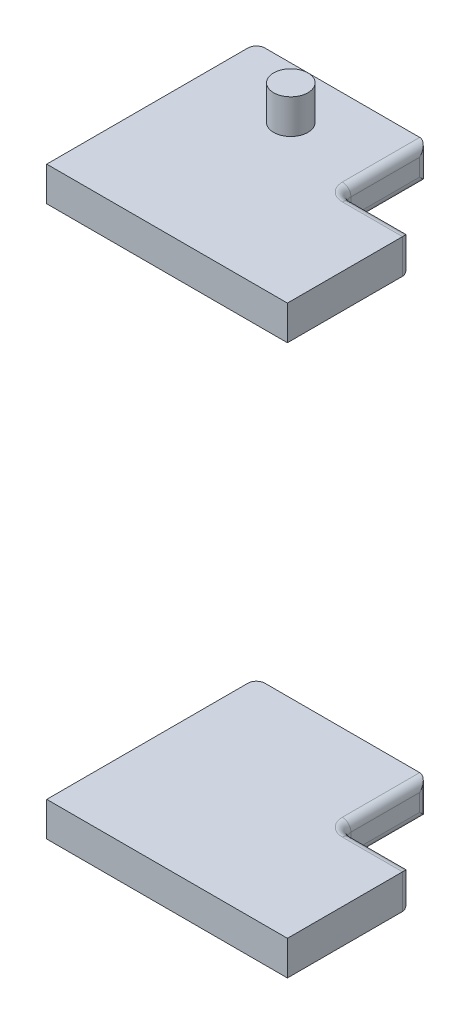
ISO-10303-21;
HEADER;
FILE_DESCRIPTION(('STEP AP214'),'2;1');
FILE_NAME('part.step','',(''),(''),'','','');
FILE_SCHEMA(('AUTOMOTIVE_DESIGN { 1 0 10303 214 1 1 1 1 }'));
ENDSEC;
DATA;
#1=APPLICATION_CONTEXT('core data for automotive mechanical design processes');
#2=APPLICATION_PROTOCOL_DEFINITION('international standard','automotive_design',2000,#1);
#3=PRODUCT_CONTEXT('',#1,'mechanical');
#4=PRODUCT('Part','Part','',(#3));
#5=PRODUCT_RELATED_PRODUCT_CATEGORY('part','',(#4));
#6=PRODUCT_DEFINITION_FORMATION('','',#4);
#7=PRODUCT_DEFINITION_CONTEXT('part definition',#1,'design');
#8=PRODUCT_DEFINITION('design','',#6,#7);
#9=PRODUCT_DEFINITION_SHAPE('','',#8);
#10=(LENGTH_UNIT() NAMED_UNIT(*) SI_UNIT(.MILLI.,.METRE.));
#11=(NAMED_UNIT(*) PLANE_ANGLE_UNIT() SI_UNIT($,.RADIAN.));
#12=(NAMED_UNIT(*) SI_UNIT($,.STERADIAN.) SOLID_ANGLE_UNIT());
#13=UNCERTAINTY_MEASURE_WITH_UNIT(LENGTH_MEASURE(1.E-05),#10,'distance_accuracy_value','');
#14=(GEOMETRIC_REPRESENTATION_CONTEXT(3) GLOBAL_UNCERTAINTY_ASSIGNED_CONTEXT((#13)) GLOBAL_UNIT_ASSIGNED_CONTEXT((#10,
#11,#12)) REPRESENTATION_CONTEXT('',''));
#15=CARTESIAN_POINT('',(0.,0.,0.));
#16=DIRECTION('',(0.,0.,1.));
#17=DIRECTION('',(1.,0.,0.));
#18=AXIS2_PLACEMENT_3D('',#15,#16,#17);
#19=CARTESIAN_POINT('',(70.,-165.,-54.9999999999997));
#20=DIRECTION('',(1.,0.,0.));
#21=DIRECTION('',(0.,0.,-1.));
#22=AXIS2_PLACEMENT_3D('',#19,#20,#21);
#23=CYLINDRICAL_SURFACE('',#22,5.);
#24=CARTESIAN_POINT('',(105.,-165.,-54.9999999999997));
#25=DIRECTION('',(-1.,0.,0.));
#26=DIRECTION('',(0.,0.,-1.));
#27=AXIS2_PLACEMENT_3D('',#24,#25,#26);
#28=CIRCLE('',#27,5.);
#29=CARTESIAN_POINT('',(105.,-165.,-59.9999999999997));
#30=VERTEX_POINT('',#29);
#31=CARTESIAN_POINT('',(105.,-170.,-54.9999999999997));
#32=VERTEX_POINT('',#31);
#33=EDGE_CURVE('E66',#30,#32,#28,.T.);
#34=ORIENTED_EDGE('',*,*,#33,.F.);
#35=DIRECTION('',(-1.,0.,0.));
#36=VECTOR('',#35,1.);
#37=CARTESIAN_POINT('',(70.,-165.,-59.9999999999997));
#38=LINE('',#37,#36);
#39=CARTESIAN_POINT('',(135.,-165.,-59.9999999999997));
#40=VERTEX_POINT('',#39);
#41=EDGE_CURVE('E202',#40,#30,#38,.T.);
#42=ORIENTED_EDGE('',*,*,#41,.F.);
#43=CARTESIAN_POINT('',(135.,-165.,-54.9999999999997));
#44=DIRECTION('',(-0.707106781186547,-0.707106781186547,0.));
#45=DIRECTION('',(0.707106781186547,-0.707106781186547,0.));
#46=AXIS2_PLACEMENT_3D('',#43,#44,#45);
#47=ELLIPSE('',#46,7.07106781186547,5.);
#48=CARTESIAN_POINT('',(140.,-170.,-54.9999999999997));
#49=VERTEX_POINT('',#48);
#50=EDGE_CURVE('E199',#49,#40,#47,.F.);
#51=ORIENTED_EDGE('',*,*,#50,.F.);
#52=DIRECTION('',(-1.,0.,0.));
#53=VECTOR('',#52,1.);
#54=CARTESIAN_POINT('',(70.,-170.,-54.9999999999997));
#55=LINE('',#54,#53);
#56=EDGE_CURVE('E74',#49,#32,#55,.T.);
#57=ORIENTED_EDGE('',*,*,#56,.T.);
#58=EDGE_LOOP('',(#34,#42,#51,#57));
#59=FACE_BOUND('',#58,.T.);
#60=ADVANCED_FACE('F57',(#59),#23,.T.);
#61=CARTESIAN_POINT('',(0.,170.,-59.9999999999997));
#62=DIRECTION('',(0.,0.,1.));
#63=DIRECTION('',(1.,0.,0.));
#64=AXIS2_PLACEMENT_3D('',#61,#62,#63);
#65=PLANE('',#64);
#66=DIRECTION('',(1.,0.,0.));
#67=VECTOR('',#66,1.);
#68=CARTESIAN_POINT('',(120.,-155.,-59.9999999999997));
#69=LINE('',#68,#67);
#70=CARTESIAN_POINT('',(105.,-155.,-59.9999999999997));
#71=VERTEX_POINT('',#70);
#72=CARTESIAN_POINT('',(135.,-155.,-59.9999999999997));
#73=VERTEX_POINT('',#72);
#74=EDGE_CURVE('E198',#71,#73,#69,.T.);
#75=ORIENTED_EDGE('',*,*,#74,.T.);
#76=DIRECTION('',(0.,-1.,0.));
#77=VECTOR('',#76,1.);
#78=CARTESIAN_POINT('',(135.,-160.,-59.9999999999997));
#79=LINE('',#78,#77);
#80=EDGE_CURVE('E228',#73,#40,#79,.T.);
#81=ORIENTED_EDGE('',*,*,#80,.T.);
#82=ORIENTED_EDGE('',*,*,#41,.T.);
#83=DIRECTION('',(0.,1.,0.));
#84=VECTOR('',#83,1.);
#85=CARTESIAN_POINT('',(105.,-160.,-59.9999999999997));
#86=LINE('',#85,#84);
#87=EDGE_CURVE('E197',#30,#71,#86,.T.);
#88=ORIENTED_EDGE('',*,*,#87,.T.);
#89=EDGE_LOOP('',(#75,#81,#82,#88));
#90=FACE_BOUND('',#89,.T.);
#91=ADVANCED_FACE('F353',(#90),#65,.F.);
#92=CARTESIAN_POINT('',(135.,-160.,-54.9999999999997));
#93=DIRECTION('',(0.,-1.,0.));
#94=DIRECTION('',(0.,0.,-1.));
#95=AXIS2_PLACEMENT_3D('',#92,#93,#94);
#96=CYLINDRICAL_SURFACE('',#95,5.);
#97=CARTESIAN_POINT('',(135.,-155.,-54.9999999999997));
#98=DIRECTION('',(0.707106781186547,-0.707106781186547,0.));
#99=DIRECTION('',(-0.707106781186547,-0.707106781186547,0.));
#100=AXIS2_PLACEMENT_3D('',#97,#98,#99);
#101=ELLIPSE('',#100,7.07106781186547,5.);
#102=CARTESIAN_POINT('',(140.,-150.,-54.9999999999997));
#103=VERTEX_POINT('',#102);
#104=EDGE_CURVE('E193',#73,#103,#101,.T.);
#105=ORIENTED_EDGE('',*,*,#104,.T.);
#106=DIRECTION('',(0.,-1.,0.));
#107=VECTOR('',#106,1.);
#108=CARTESIAN_POINT('',(140.,-160.,-54.9999999999997));
#109=LINE('',#108,#107);
#110=EDGE_CURVE('E191',#103,#49,#109,.T.);
#111=ORIENTED_EDGE('',*,*,#110,.T.);
#112=ORIENTED_EDGE('',*,*,#50,.T.);
#113=ORIENTED_EDGE('',*,*,#80,.F.);
#114=EDGE_LOOP('',(#105,#111,#112,#113));
#115=FACE_BOUND('',#114,.T.);
#116=ADVANCED_FACE('F324',(#115),#96,.T.);
#117=CARTESIAN_POINT('',(0.,-170.,-59.9999999999998));
#118=DIRECTION('',(0.,1.,0.));
#119=DIRECTION('',(0.,0.,1.));
#120=AXIS2_PLACEMENT_3D('',#117,#118,#119);
#121=PLANE('',#120);
#122=CARTESIAN_POINT('',(50.,-170.,-79.9999999999997));
#123=DIRECTION('',(0.,1.,0.));
#124=DIRECTION('',(0.,0.,1.));
#125=AXIS2_PLACEMENT_3D('',#122,#123,#124);
#126=CIRCLE('',#125,10.);
#127=CARTESIAN_POINT('',(50.,-170.,-69.9999999999996));
#128=VERTEX_POINT('',#127);
#129=EDGE_CURVE('E13',#128,#128,#126,.F.);
#130=ORIENTED_EDGE('',*,*,#129,.F.);
#131=EDGE_LOOP('',(#130));
#132=FACE_BOUND('',#131,.T.);
#133=DIRECTION('',(0.,0.,-1.));
#134=VECTOR('',#133,1.);
#135=CARTESIAN_POINT('',(140.,-170.,-21.5224999999996));
#136=LINE('',#135,#134);
#137=CARTESIAN_POINT('',(140.,-170.,11.9550000000004));
#138=VERTEX_POINT('',#137);
#139=EDGE_CURVE('E232',#138,#49,#136,.T.);
#140=ORIENTED_EDGE('',*,*,#139,.F.);
#141=DIRECTION('',(-1.,0.,0.));
#142=VECTOR('',#141,1.);
#143=CARTESIAN_POINT('',(70.,-170.,11.9550000000004));
#144=LINE('',#143,#142);
#145=CARTESIAN_POINT('',(0.,-170.,11.9550000000004));
#146=VERTEX_POINT('',#145);
#147=EDGE_CURVE('E256',#138,#146,#144,.T.);
#148=ORIENTED_EDGE('',*,*,#147,.T.);
#149=DIRECTION('',(0.,0.,-1.));
#150=VECTOR('',#149,1.);
#151=CARTESIAN_POINT('',(0.,-170.,-46.5224999999996));
#152=LINE('',#151,#150);
#153=CARTESIAN_POINT('',(0.,-170.,-105.));
#154=VERTEX_POINT('',#153);
#155=EDGE_CURVE('E271',#146,#154,#152,.T.);
#156=ORIENTED_EDGE('',*,*,#155,.T.);
#157=CARTESIAN_POINT('',(5.,-170.,-105.));
#158=DIRECTION('',(0.,1.,0.));
#159=DIRECTION('',(0.,0.,1.));
#160=AXIS2_PLACEMENT_3D('',#157,#158,#159);
#161=CIRCLE('',#160,5.);
#162=CARTESIAN_POINT('',(5.,-170.,-110.));
#163=VERTEX_POINT('',#162);
#164=EDGE_CURVE('E212',#163,#154,#161,.T.);
#165=ORIENTED_EDGE('',*,*,#164,.F.);
#166=DIRECTION('',(-1.,0.,0.));
#167=VECTOR('',#166,1.);
#168=CARTESIAN_POINT('',(50.,-170.,-110.));
#169=LINE('',#168,#167);
#170=CARTESIAN_POINT('',(95.,-170.,-110.));
#171=VERTEX_POINT('',#170);
#172=EDGE_CURVE('E209',#171,#163,#169,.T.);
#173=ORIENTED_EDGE('',*,*,#172,.F.);
#174=DIRECTION('',(0.,0.,-1.));
#175=VECTOR('',#174,1.);
#176=CARTESIAN_POINT('',(95.,-170.,-87.4999999999997));
#177=LINE('',#176,#175);
#178=CARTESIAN_POINT('',(95.,-170.,-65.0000002732813));
#179=VERTEX_POINT('',#178);
#180=EDGE_CURVE('E204',#179,#171,#177,.T.);
#181=ORIENTED_EDGE('',*,*,#180,.F.);
#182=CARTESIAN_POINT('',(105.,-170.,-64.9999999999997));
#183=DIRECTION('',(0.,-1.,0.));
#184=DIRECTION('',(0.,0.,1.));
#185=AXIS2_PLACEMENT_3D('',#182,#183,#184);
#186=CIRCLE('',#185,10.);
#187=EDGE_CURVE('E208',#32,#179,#186,.T.);
#188=ORIENTED_EDGE('',*,*,#187,.F.);
#189=ORIENTED_EDGE('',*,*,#56,.F.);
#190=EDGE_LOOP('',(#140,#148,#156,#165,#173,#181,#188,#189));
#191=FACE_BOUND('',#190,.T.);
#192=ADVANCED_FACE('F320',(#132,#191),#121,.F.);
#193=CARTESIAN_POINT('',(105.,-165.,-64.9999999999997));
#194=DIRECTION('',(0.,1.,0.));
#195=DIRECTION('',(-0.980849428772772,0.,-0.194767548827127));
#196=AXIS2_PLACEMENT_3D('',#193,#194,#195);
#197=TOROIDAL_SURFACE('',#196,10.,5.);
#198=CARTESIAN_POINT('',(105.,-165.,-64.9999999999997));
#199=DIRECTION('',(0.,-1.,0.));
#200=DIRECTION('',(0.,0.,1.));
#201=AXIS2_PLACEMENT_3D('',#198,#199,#200);
#202=CIRCLE('',#201,5.);
#203=CARTESIAN_POINT('',(100.,-165.,-64.9999999999997));
#204=VERTEX_POINT('',#203);
#205=EDGE_CURVE('E290',#30,#204,#202,.T.);
#206=ORIENTED_EDGE('',*,*,#205,.F.);
#207=ORIENTED_EDGE('',*,*,#33,.T.);
#208=ORIENTED_EDGE('',*,*,#187,.T.);
#209=CARTESIAN_POINT('',(95.,-165.,-65.0000002732813));
#210=DIRECTION('',(2.73281642870771E-08,0.,-1.));
#211=DIRECTION('',(-1.,0.,-2.73281642870771E-08));
#212=AXIS2_PLACEMENT_3D('',#209,#210,#211);
#213=CIRCLE('',#212,5.);
#214=EDGE_CURVE('E286',#204,#179,#213,.T.);
#215=ORIENTED_EDGE('',*,*,#214,.F.);
#216=EDGE_LOOP('',(#206,#207,#208,#215));
#217=FACE_BOUND('',#216,.T.);
#218=ADVANCED_FACE('F323',(#217),#197,.T.);
#219=CARTESIAN_POINT('',(105.,-160.,-64.9999999999997));
#220=DIRECTION('',(0.,-1.,0.));
#221=DIRECTION('',(0.,0.,-1.));
#222=AXIS2_PLACEMENT_3D('',#219,#220,#221);
#223=CYLINDRICAL_SURFACE('',#222,5.);
#224=ORIENTED_EDGE('',*,*,#87,.F.);
#225=ORIENTED_EDGE('',*,*,#205,.T.);
#226=DIRECTION('',(0.,1.,0.));
#227=VECTOR('',#226,1.);
#228=CARTESIAN_POINT('',(100.,-160.,-64.9999999999997));
#229=LINE('',#228,#227);
#230=CARTESIAN_POINT('',(100.,-155.,-64.9999999821408));
#231=VERTEX_POINT('',#230);
#232=EDGE_CURVE('E217',#204,#231,#229,.T.);
#233=ORIENTED_EDGE('',*,*,#232,.T.);
#234=CARTESIAN_POINT('',(105.,-155.,-64.9999999999997));
#235=DIRECTION('',(0.,1.,0.));
#236=DIRECTION('',(0.,0.,-1.));
#237=AXIS2_PLACEMENT_3D('',#234,#235,#236);
#238=CIRCLE('',#237,5.);
#239=EDGE_CURVE('E272',#231,#71,#238,.T.);
#240=ORIENTED_EDGE('',*,*,#239,.T.);
#241=EDGE_LOOP('',(#224,#225,#233,#240));
#242=FACE_BOUND('',#241,.T.);
#243=ADVANCED_FACE('F367',(#242),#223,.F.);
#244=CARTESIAN_POINT('',(70.,-155.,-54.9999999999997));
#245=DIRECTION('',(1.,0.,0.));
#246=DIRECTION('',(0.,0.,-1.));
#247=AXIS2_PLACEMENT_3D('',#244,#245,#246);
#248=CYLINDRICAL_SURFACE('',#247,5.);
#249=ORIENTED_EDGE('',*,*,#104,.F.);
#250=ORIENTED_EDGE('',*,*,#74,.F.);
#251=CARTESIAN_POINT('',(105.,-155.,-54.9999999999997));
#252=DIRECTION('',(1.,0.,0.));
#253=DIRECTION('',(0.,0.,-1.));
#254=AXIS2_PLACEMENT_3D('',#251,#252,#253);
#255=CIRCLE('',#254,5.);
#256=CARTESIAN_POINT('',(105.,-150.,-54.9999999999997));
#257=VERTEX_POINT('',#256);
#258=EDGE_CURVE('E216',#71,#257,#255,.T.);
#259=ORIENTED_EDGE('',*,*,#258,.T.);
#260=DIRECTION('',(1.,0.,0.));
#261=VECTOR('',#260,1.);
#262=CARTESIAN_POINT('',(70.,-150.,-54.9999999999997));
#263=LINE('',#262,#261);
#264=EDGE_CURVE('E222',#257,#103,#263,.T.);
#265=ORIENTED_EDGE('',*,*,#264,.T.);
#266=EDGE_LOOP('',(#249,#250,#259,#265));
#267=FACE_BOUND('',#266,.T.);
#268=ADVANCED_FACE('F371',(#267),#248,.T.);
#269=CARTESIAN_POINT('',(140.,0.,0.));
#270=DIRECTION('',(1.,0.,0.));
#271=DIRECTION('',(0.,0.,-1.));
#272=AXIS2_PLACEMENT_3D('',#269,#270,#271);
#273=PLANE('',#272);
#274=DIRECTION('',(0.,1.,0.));
#275=VECTOR('',#274,1.);
#276=CARTESIAN_POINT('',(140.,-160.,11.9550000000004));
#277=LINE('',#276,#275);
#278=CARTESIAN_POINT('',(140.,-150.,11.9550000000004));
#279=VERTEX_POINT('',#278);
#280=EDGE_CURVE('E227',#138,#279,#277,.T.);
#281=ORIENTED_EDGE('',*,*,#280,.F.);
#282=ORIENTED_EDGE('',*,*,#139,.T.);
#283=ORIENTED_EDGE('',*,*,#110,.F.);
#284=DIRECTION('',(0.,0.,1.));
#285=VECTOR('',#284,1.);
#286=CARTESIAN_POINT('',(140.,-150.,-21.5224999999996));
#287=LINE('',#286,#285);
#288=EDGE_CURVE('E155',#103,#279,#287,.T.);
#289=ORIENTED_EDGE('',*,*,#288,.T.);
#290=EDGE_LOOP('',(#281,#282,#283,#289));
#291=FACE_BOUND('',#290,.T.);
#292=ADVANCED_FACE('F332',(#291),#273,.T.);
#293=CARTESIAN_POINT('',(95.,-165.,-24.9999999999996));
#294=DIRECTION('',(0.,0.,-1.));
#295=DIRECTION('',(-1.,0.,0.));
#296=AXIS2_PLACEMENT_3D('',#293,#294,#295);
#297=CYLINDRICAL_SURFACE('',#296,5.);
#298=CARTESIAN_POINT('',(95.,-165.,-105.));
#299=DIRECTION('',(0.,-0.707106781186547,0.707106781186547));
#300=DIRECTION('',(0.,-0.707106781186547,-0.707106781186547));
#301=AXIS2_PLACEMENT_3D('',#298,#299,#300);
#302=ELLIPSE('',#301,7.07106781186547,5.);
#303=CARTESIAN_POINT('',(100.,-165.,-105.));
#304=VERTEX_POINT('',#303);
#305=EDGE_CURVE('E149',#304,#171,#302,.F.);
#306=ORIENTED_EDGE('',*,*,#305,.F.);
#307=DIRECTION('',(0.,0.,-1.));
#308=VECTOR('',#307,1.);
#309=CARTESIAN_POINT('',(100.,-165.,-24.9999999999996));
#310=LINE('',#309,#308);
#311=EDGE_CURVE('E192',#204,#304,#310,.T.);
#312=ORIENTED_EDGE('',*,*,#311,.F.);
#313=ORIENTED_EDGE('',*,*,#214,.T.);
#314=ORIENTED_EDGE('',*,*,#180,.T.);
#315=EDGE_LOOP('',(#306,#312,#313,#314));
#316=FACE_BOUND('',#315,.T.);
#317=ADVANCED_FACE('F350',(#316),#297,.T.);
#318=CARTESIAN_POINT('',(0.,0.,-110.));
#319=DIRECTION('',(0.,0.,-1.));
#320=DIRECTION('',(-1.,0.,0.));
#321=AXIS2_PLACEMENT_3D('',#318,#319,#320);
#322=PLANE('',#321);
#323=DIRECTION('',(0.,1.,0.));
#324=VECTOR('',#323,1.);
#325=CARTESIAN_POINT('',(5.,-160.,-110.));
#326=LINE('',#325,#324);
#327=CARTESIAN_POINT('',(5.,-150.,-110.));
#328=VERTEX_POINT('',#327);
#329=EDGE_CURVE('E172',#163,#328,#326,.T.);
#330=ORIENTED_EDGE('',*,*,#329,.T.);
#331=DIRECTION('',(1.,0.,0.));
#332=VECTOR('',#331,1.);
#333=CARTESIAN_POINT('',(50.,-150.,-110.));
#334=LINE('',#333,#332);
#335=CARTESIAN_POINT('',(95.,-150.,-110.));
#336=VERTEX_POINT('',#335);
#337=EDGE_CURVE('E163',#328,#336,#334,.T.);
#338=ORIENTED_EDGE('',*,*,#337,.T.);
#339=DIRECTION('',(0.,-1.,0.));
#340=VECTOR('',#339,1.);
#341=CARTESIAN_POINT('',(95.,-160.,-110.));
#342=LINE('',#341,#340);
#343=EDGE_CURVE('E142',#336,#171,#342,.T.);
#344=ORIENTED_EDGE('',*,*,#343,.T.);
#345=ORIENTED_EDGE('',*,*,#172,.T.);
#346=EDGE_LOOP('',(#330,#338,#344,#345));
#347=FACE_BOUND('',#346,.T.);
#348=ADVANCED_FACE('F170',(#347),#322,.T.);
#349=CARTESIAN_POINT('',(5.,0.,-105.));
#350=DIRECTION('',(0.,-1.,0.));
#351=DIRECTION('',(0.,0.,-1.));
#352=AXIS2_PLACEMENT_3D('',#349,#350,#351);
#353=CYLINDRICAL_SURFACE('',#352,5.);
#354=DIRECTION('',(0.,1.,0.));
#355=VECTOR('',#354,1.);
#356=CARTESIAN_POINT('',(0.,0.,-105.));
#357=LINE('',#356,#355);
#358=CARTESIAN_POINT('',(0.,-150.,-105.));
#359=VERTEX_POINT('',#358);
#360=EDGE_CURVE('E267',#154,#359,#357,.T.);
#361=ORIENTED_EDGE('',*,*,#360,.T.);
#362=CARTESIAN_POINT('',(5.,-150.,-105.));
#363=DIRECTION('',(0.,-1.,0.));
#364=DIRECTION('',(0.,0.,-1.));
#365=AXIS2_PLACEMENT_3D('',#362,#363,#364);
#366=CIRCLE('',#365,5.);
#367=EDGE_CURVE('E175',#359,#328,#366,.T.);
#368=ORIENTED_EDGE('',*,*,#367,.T.);
#369=ORIENTED_EDGE('',*,*,#329,.F.);
#370=ORIENTED_EDGE('',*,*,#164,.T.);
#371=EDGE_LOOP('',(#361,#368,#369,#370));
#372=FACE_BOUND('',#371,.T.);
#373=ADVANCED_FACE('F341',(#372),#353,.T.);
#374=CARTESIAN_POINT('',(0.,0.,0.));
#375=DIRECTION('',(1.,0.,0.));
#376=DIRECTION('',(0.,0.,-1.));
#377=AXIS2_PLACEMENT_3D('',#374,#375,#376);
#378=PLANE('',#377);
#379=ORIENTED_EDGE('',*,*,#155,.F.);
#380=DIRECTION('',(0.,1.,0.));
#381=VECTOR('',#380,1.);
#382=CARTESIAN_POINT('',(0.,-160.,11.9550000000004));
#383=LINE('',#382,#381);
#384=CARTESIAN_POINT('',(0.,-150.,11.9550000000004));
#385=VERTEX_POINT('',#384);
#386=EDGE_CURVE('E252',#146,#385,#383,.T.);
#387=ORIENTED_EDGE('',*,*,#386,.T.);
#388=DIRECTION('',(0.,0.,-1.));
#389=VECTOR('',#388,1.);
#390=CARTESIAN_POINT('',(0.,-150.,-46.5224999999996));
#391=LINE('',#390,#389);
#392=EDGE_CURVE('E261',#385,#359,#391,.T.);
#393=ORIENTED_EDGE('',*,*,#392,.T.);
#394=ORIENTED_EDGE('',*,*,#360,.F.);
#395=EDGE_LOOP('',(#379,#387,#393,#394));
#396=FACE_BOUND('',#395,.T.);
#397=ADVANCED_FACE('F339',(#396),#378,.F.);
#398=CARTESIAN_POINT('',(105.,-155.,-64.9999999999997));
#399=DIRECTION('',(0.,-1.,0.));
#400=DIRECTION('',(0.146304903087773,0.,0.989239543959135));
#401=AXIS2_PLACEMENT_3D('',#398,#399,#400);
#402=TOROIDAL_SURFACE('',#401,10.,5.);
#403=ORIENTED_EDGE('',*,*,#239,.F.);
#404=CARTESIAN_POINT('',(95.,-155.,-64.999999964282));
#405=DIRECTION('',(3.57177037946244E-09,0.,1.));
#406=DIRECTION('',(1.,0.,-3.57177037946244E-09));
#407=AXIS2_PLACEMENT_3D('',#404,#405,#406);
#408=CIRCLE('',#407,5.);
#409=CARTESIAN_POINT('',(95.,-150.,-64.9999999999997));
#410=VERTEX_POINT('',#409);
#411=EDGE_CURVE('E186',#231,#410,#408,.T.);
#412=ORIENTED_EDGE('',*,*,#411,.T.);
#413=CARTESIAN_POINT('',(105.,-150.,-64.9999999999997));
#414=DIRECTION('',(0.,1.,0.));
#415=DIRECTION('',(0.,0.,-1.));
#416=AXIS2_PLACEMENT_3D('',#413,#414,#415);
#417=CIRCLE('',#416,10.);
#418=EDGE_CURVE('E166',#410,#257,#417,.T.);
#419=ORIENTED_EDGE('',*,*,#418,.T.);
#420=ORIENTED_EDGE('',*,*,#258,.F.);
#421=EDGE_LOOP('',(#403,#412,#419,#420));
#422=FACE_BOUND('',#421,.T.);
#423=ADVANCED_FACE('F348',(#422),#402,.T.);
#424=CARTESIAN_POINT('',(100.,170.,-59.9999999999997));
#425=DIRECTION('',(1.,0.,0.));
#426=DIRECTION('',(0.,0.,-1.));
#427=AXIS2_PLACEMENT_3D('',#424,#425,#426);
#428=PLANE('',#427);
#429=DIRECTION('',(0.,-1.,0.));
#430=VECTOR('',#429,1.);
#431=CARTESIAN_POINT('',(100.,-160.,-105.));
#432=LINE('',#431,#430);
#433=CARTESIAN_POINT('',(100.,-155.,-105.));
#434=VERTEX_POINT('',#433);
#435=EDGE_CURVE('E213',#434,#304,#432,.T.);
#436=ORIENTED_EDGE('',*,*,#435,.F.);
#437=DIRECTION('',(0.,0.,1.));
#438=VECTOR('',#437,1.);
#439=CARTESIAN_POINT('',(100.,-155.,-84.9999999999997));
#440=LINE('',#439,#438);
#441=EDGE_CURVE('E180',#434,#231,#440,.T.);
#442=ORIENTED_EDGE('',*,*,#441,.T.);
#443=ORIENTED_EDGE('',*,*,#232,.F.);
#444=ORIENTED_EDGE('',*,*,#311,.T.);
#445=EDGE_LOOP('',(#436,#442,#443,#444));
#446=FACE_BOUND('',#445,.T.);
#447=ADVANCED_FACE('F384',(#446),#428,.T.);
#448=CARTESIAN_POINT('',(0.,-150.,-59.9999999999997));
#449=DIRECTION('',(0.,-1.,0.));
#450=DIRECTION('',(0.,0.,-1.));
#451=AXIS2_PLACEMENT_3D('',#448,#449,#450);
#452=PLANE('',#451);
#453=ORIENTED_EDGE('',*,*,#392,.F.);
#454=DIRECTION('',(1.,0.,0.));
#455=VECTOR('',#454,1.);
#456=CARTESIAN_POINT('',(70.,-150.,11.9550000000004));
#457=LINE('',#456,#455);
#458=EDGE_CURVE('E248',#385,#279,#457,.T.);
#459=ORIENTED_EDGE('',*,*,#458,.T.);
#460=ORIENTED_EDGE('',*,*,#288,.F.);
#461=ORIENTED_EDGE('',*,*,#264,.F.);
#462=ORIENTED_EDGE('',*,*,#418,.F.);
#463=DIRECTION('',(0.,0.,1.));
#464=VECTOR('',#463,1.);
#465=CARTESIAN_POINT('',(95.,-150.,-87.4999999999997));
#466=LINE('',#465,#464);
#467=EDGE_CURVE('E160',#336,#410,#466,.T.);
#468=ORIENTED_EDGE('',*,*,#467,.F.);
#469=ORIENTED_EDGE('',*,*,#337,.F.);
#470=ORIENTED_EDGE('',*,*,#367,.F.);
#471=EDGE_LOOP('',(#453,#459,#460,#461,#462,#468,#469,#470));
#472=FACE_BOUND('',#471,.T.);
#473=ADVANCED_FACE('F162',(#472),#452,.F.);
#474=CARTESIAN_POINT('',(95.,-160.,-105.));
#475=DIRECTION('',(0.,-1.,0.));
#476=DIRECTION('',(0.,0.,-1.));
#477=AXIS2_PLACEMENT_3D('',#474,#475,#476);
#478=CYLINDRICAL_SURFACE('',#477,5.);
#479=ORIENTED_EDGE('',*,*,#435,.T.);
#480=ORIENTED_EDGE('',*,*,#305,.T.);
#481=ORIENTED_EDGE('',*,*,#343,.F.);
#482=CARTESIAN_POINT('',(95.,-155.,-105.));
#483=DIRECTION('',(0.,-0.707106781186547,-0.707106781186547));
#484=DIRECTION('',(0.,-0.707106781186547,0.707106781186547));
#485=AXIS2_PLACEMENT_3D('',#482,#483,#484);
#486=ELLIPSE('',#485,7.07106781186547,5.);
#487=EDGE_CURVE('E147',#336,#434,#486,.T.);
#488=ORIENTED_EDGE('',*,*,#487,.T.);
#489=EDGE_LOOP('',(#479,#480,#481,#488));
#490=FACE_BOUND('',#489,.T.);
#491=ADVANCED_FACE('F145',(#490),#478,.T.);
#492=CARTESIAN_POINT('',(95.,-155.,-24.9999999999997));
#493=DIRECTION('',(0.,0.,1.));
#494=DIRECTION('',(1.,0.,0.));
#495=AXIS2_PLACEMENT_3D('',#492,#493,#494);
#496=CYLINDRICAL_SURFACE('',#495,5.);
#497=ORIENTED_EDGE('',*,*,#487,.F.);
#498=ORIENTED_EDGE('',*,*,#467,.T.);
#499=ORIENTED_EDGE('',*,*,#411,.F.);
#500=ORIENTED_EDGE('',*,*,#441,.F.);
#501=EDGE_LOOP('',(#497,#498,#499,#500));
#502=FACE_BOUND('',#501,.T.);
#503=ADVANCED_FACE('F178',(#502),#496,.T.);
#504=CARTESIAN_POINT('',(0.,-185.249526977539,11.9550000000004));
#505=DIRECTION('',(0.,0.,-1.));
#506=DIRECTION('',(-1.,0.,0.));
#507=AXIS2_PLACEMENT_3D('',#504,#505,#506);
#508=PLANE('',#507);
#509=ORIENTED_EDGE('',*,*,#280,.T.);
#510=ORIENTED_EDGE('',*,*,#458,.F.);
#511=ORIENTED_EDGE('',*,*,#386,.F.);
#512=ORIENTED_EDGE('',*,*,#147,.F.);
#513=EDGE_LOOP('',(#509,#510,#511,#512));
#514=FACE_BOUND('',#513,.T.);
#515=ADVANCED_FACE('F59',(#514),#508,.F.);
#516=CARTESIAN_POINT('',(50.,-190.,-79.9999999999997));
#517=DIRECTION('',(0.,-1.,0.));
#518=DIRECTION('',(0.,0.,-1.));
#519=AXIS2_PLACEMENT_3D('',#516,#517,#518);
#520=CYLINDRICAL_SURFACE('',#519,10.);
#521=CARTESIAN_POINT('',(50.,-190.,-79.9999999999997));
#522=DIRECTION('',(0.,-1.,0.));
#523=DIRECTION('',(0.,0.,-1.));
#524=AXIS2_PLACEMENT_3D('',#521,#522,#523);
#525=CIRCLE('',#524,10.);
#526=CARTESIAN_POINT('',(50.,-190.,-89.9999999999997));
#527=VERTEX_POINT('',#526);
#528=EDGE_CURVE('E253',#527,#527,#525,.T.);
#529=ORIENTED_EDGE('',*,*,#528,.F.);
#530=EDGE_LOOP('',(#529));
#531=FACE_BOUND('',#530,.T.);
#532=ORIENTED_EDGE('',*,*,#129,.T.);
#533=EDGE_LOOP('',(#532));
#534=FACE_BOUND('',#533,.T.);
#535=ADVANCED_FACE('F314',(#531,#534),#520,.T.);
#536=CARTESIAN_POINT('',(60.,-190.,-79.9999999999997));
#537=DIRECTION('',(0.,1.,0.));
#538=DIRECTION('',(0.,0.,1.));
#539=AXIS2_PLACEMENT_3D('',#536,#537,#538);
#540=PLANE('',#539);
#541=ORIENTED_EDGE('',*,*,#528,.T.);
#542=EDGE_LOOP('',(#541));
#543=FACE_BOUND('',#542,.T.);
#544=ADVANCED_FACE('F312',(#543),#540,.F.);
#545=CLOSED_SHELL('',(#60,#91,#116,#192,#218,#243,#268,#292,#317,#348,#373,#397,#423,#447,#473,
#491,#503,#515,#535,#544));
#546=MANIFOLD_SOLID_BREP('B2',#545);
#547=CARTESIAN_POINT('',(0.,150.,11.9550000000004));
#548=DIRECTION('',(0.,0.,1.));
#549=DIRECTION('',(1.,0.,0.));
#550=AXIS2_PLACEMENT_3D('',#547,#548,#549);
#551=PLANE('',#550);
#552=DIRECTION('',(1.,0.,0.));
#553=VECTOR('',#552,1.);
#554=CARTESIAN_POINT('',(0.,170.,11.9550000000004));
#555=LINE('',#554,#553);
#556=CARTESIAN_POINT('',(0.,170.,11.9550000000004));
#557=VERTEX_POINT('',#556);
#558=CARTESIAN_POINT('',(140.,170.,11.9550000000004));
#559=VERTEX_POINT('',#558);
#560=EDGE_CURVE('E894',#557,#559,#555,.T.);
#561=ORIENTED_EDGE('',*,*,#560,.F.);
#562=DIRECTION('',(0.,1.,0.));
#563=VECTOR('',#562,1.);
#564=CARTESIAN_POINT('',(0.,150.,11.9550000000004));
#565=LINE('',#564,#563);
#566=CARTESIAN_POINT('',(0.,150.,11.9550000000004));
#567=VERTEX_POINT('',#566);
#568=EDGE_CURVE('E871',#567,#557,#565,.T.);
#569=ORIENTED_EDGE('',*,*,#568,.F.);
#570=DIRECTION('',(1.,0.,0.));
#571=VECTOR('',#570,1.);
#572=CARTESIAN_POINT('',(0.,150.,11.9550000000004));
#573=LINE('',#572,#571);
#574=CARTESIAN_POINT('',(140.,150.,11.9550000000004));
#575=VERTEX_POINT('',#574);
#576=EDGE_CURVE('E877',#567,#575,#573,.T.);
#577=ORIENTED_EDGE('',*,*,#576,.T.);
#578=DIRECTION('',(0.,1.,0.));
#579=VECTOR('',#578,1.);
#580=CARTESIAN_POINT('',(140.,150.,11.9550000000004));
#581=LINE('',#580,#579);
#582=EDGE_CURVE('E859',#575,#559,#581,.T.);
#583=ORIENTED_EDGE('',*,*,#582,.T.);
#584=EDGE_LOOP('',(#561,#569,#577,#583));
#585=FACE_BOUND('',#584,.T.);
#586=ADVANCED_FACE('F769',(#585),#551,.T.);
#587=CARTESIAN_POINT('',(0.,150.,-110.));
#588=DIRECTION('',(-1.,0.,0.));
#589=DIRECTION('',(0.,0.,1.));
#590=AXIS2_PLACEMENT_3D('',#587,#588,#589);
#591=PLANE('',#590);
#592=DIRECTION('',(0.,0.,1.));
#593=VECTOR('',#592,1.);
#594=CARTESIAN_POINT('',(0.,170.,-110.));
#595=LINE('',#594,#593);
#596=CARTESIAN_POINT('',(0.,170.,-105.));
#597=VERTEX_POINT('',#596);
#598=EDGE_CURVE('E884',#597,#557,#595,.T.);
#599=ORIENTED_EDGE('',*,*,#598,.F.);
#600=DIRECTION('',(0.,1.,0.));
#601=VECTOR('',#600,1.);
#602=CARTESIAN_POINT('',(0.,150.,-105.));
#603=LINE('',#602,#601);
#604=CARTESIAN_POINT('',(0.,150.,-105.));
#605=VERTEX_POINT('',#604);
#606=EDGE_CURVE('E55',#597,#605,#603,.F.);
#607=ORIENTED_EDGE('',*,*,#606,.T.);
#608=DIRECTION('',(0.,0.,1.));
#609=VECTOR('',#608,1.);
#610=CARTESIAN_POINT('',(0.,150.,-110.));
#611=LINE('',#610,#609);
#612=EDGE_CURVE('E872',#605,#567,#611,.T.);
#613=ORIENTED_EDGE('',*,*,#612,.T.);
#614=ORIENTED_EDGE('',*,*,#568,.T.);
#615=EDGE_LOOP('',(#599,#607,#613,#614));
#616=FACE_BOUND('',#615,.T.);
#617=ADVANCED_FACE('F990',(#616),#591,.T.);
#618=CARTESIAN_POINT('',(140.,150.,-110.));
#619=DIRECTION('',(0.,0.,-1.));
#620=DIRECTION('',(-1.,0.,0.));
#621=AXIS2_PLACEMENT_3D('',#618,#619,#620);
#622=PLANE('',#621);
#623=DIRECTION('',(-1.,0.,0.));
#624=VECTOR('',#623,1.);
#625=CARTESIAN_POINT('',(140.,170.,-110.));
#626=LINE('',#625,#624);
#627=CARTESIAN_POINT('',(95.,170.,-110.));
#628=VERTEX_POINT('',#627);
#629=CARTESIAN_POINT('',(5.,170.,-110.));
#630=VERTEX_POINT('',#629);
#631=EDGE_CURVE('E886',#628,#630,#626,.T.);
#632=ORIENTED_EDGE('',*,*,#631,.F.);
#633=DIRECTION('',(0.,-1.,0.));
#634=VECTOR('',#633,1.);
#635=CARTESIAN_POINT('',(95.,150.,-110.));
#636=LINE('',#635,#634);
#637=CARTESIAN_POINT('',(95.,150.,-110.));
#638=VERTEX_POINT('',#637);
#639=EDGE_CURVE('E778',#628,#638,#636,.T.);
#640=ORIENTED_EDGE('',*,*,#639,.T.);
#641=DIRECTION('',(-1.,0.,0.));
#642=VECTOR('',#641,1.);
#643=CARTESIAN_POINT('',(140.,150.,-110.));
#644=LINE('',#643,#642);
#645=CARTESIAN_POINT('',(5.,150.,-110.));
#646=VERTEX_POINT('',#645);
#647=EDGE_CURVE('E880',#638,#646,#644,.T.);
#648=ORIENTED_EDGE('',*,*,#647,.T.);
#649=DIRECTION('',(0.,1.,0.));
#650=VECTOR('',#649,1.);
#651=CARTESIAN_POINT('',(5.,150.,-110.));
#652=LINE('',#651,#650);
#653=EDGE_CURVE('E937',#646,#630,#652,.T.);
#654=ORIENTED_EDGE('',*,*,#653,.T.);
#655=EDGE_LOOP('',(#632,#640,#648,#654));
#656=FACE_BOUND('',#655,.T.);
#657=ADVANCED_FACE('F995',(#656),#622,.T.);
#658=CARTESIAN_POINT('',(140.,150.,11.9550000000004));
#659=DIRECTION('',(1.,0.,0.));
#660=DIRECTION('',(0.,0.,-1.));
#661=AXIS2_PLACEMENT_3D('',#658,#659,#660);
#662=PLANE('',#661);
#663=DIRECTION('',(0.,0.,-1.));
#664=VECTOR('',#663,1.);
#665=CARTESIAN_POINT('',(140.,150.,11.9550000000004));
#666=LINE('',#665,#664);
#667=CARTESIAN_POINT('',(140.,150.,-54.9999999999997));
#668=VERTEX_POINT('',#667);
#669=EDGE_CURVE('E863',#575,#668,#666,.T.);
#670=ORIENTED_EDGE('',*,*,#669,.T.);
#671=DIRECTION('',(0.,-1.,0.));
#672=VECTOR('',#671,1.);
#673=CARTESIAN_POINT('',(140.,170.,-54.9999999999997));
#674=LINE('',#673,#672);
#675=CARTESIAN_POINT('',(140.,170.,-54.9999999999997));
#676=VERTEX_POINT('',#675);
#677=EDGE_CURVE('E912',#668,#676,#674,.F.);
#678=ORIENTED_EDGE('',*,*,#677,.T.);
#679=DIRECTION('',(0.,0.,-1.));
#680=VECTOR('',#679,1.);
#681=CARTESIAN_POINT('',(140.,170.,11.9550000000004));
#682=LINE('',#681,#680);
#683=EDGE_CURVE('E866',#559,#676,#682,.T.);
#684=ORIENTED_EDGE('',*,*,#683,.F.);
#685=ORIENTED_EDGE('',*,*,#582,.F.);
#686=EDGE_LOOP('',(#670,#678,#684,#685));
#687=FACE_BOUND('',#686,.T.);
#688=ADVANCED_FACE('F861',(#687),#662,.T.);
#689=CARTESIAN_POINT('',(0.,150.,0.));
#690=DIRECTION('',(0.,1.,0.));
#691=DIRECTION('',(0.,0.,1.));
#692=AXIS2_PLACEMENT_3D('',#689,#690,#691);
#693=PLANE('',#692);
#694=ORIENTED_EDGE('',*,*,#647,.F.);
#695=DIRECTION('',(0.,0.,-1.));
#696=VECTOR('',#695,1.);
#697=CARTESIAN_POINT('',(95.,150.,0.));
#698=LINE('',#697,#696);
#699=CARTESIAN_POINT('',(95.,150.,-64.9999999999997));
#700=VERTEX_POINT('',#699);
#701=EDGE_CURVE('E786',#638,#700,#698,.F.);
#702=ORIENTED_EDGE('',*,*,#701,.T.);
#703=CARTESIAN_POINT('',(105.,150.,-64.9999999999997));
#704=DIRECTION('',(0.,1.,0.));
#705=DIRECTION('',(0.,0.,1.));
#706=AXIS2_PLACEMENT_3D('',#703,#704,#705);
#707=CIRCLE('',#706,10.);
#708=CARTESIAN_POINT('',(105.,150.,-54.9999999999997));
#709=VERTEX_POINT('',#708);
#710=EDGE_CURVE('E791',#709,#700,#707,.F.);
#711=ORIENTED_EDGE('',*,*,#710,.F.);
#712=DIRECTION('',(-1.,0.,0.));
#713=VECTOR('',#712,1.);
#714=CARTESIAN_POINT('',(0.,150.,-54.9999999999997));
#715=LINE('',#714,#713);
#716=EDGE_CURVE('E879',#709,#668,#715,.F.);
#717=ORIENTED_EDGE('',*,*,#716,.T.);
#718=ORIENTED_EDGE('',*,*,#669,.F.);
#719=ORIENTED_EDGE('',*,*,#576,.F.);
#720=ORIENTED_EDGE('',*,*,#612,.F.);
#721=CARTESIAN_POINT('',(5.,150.,-105.));
#722=DIRECTION('',(0.,1.,0.));
#723=DIRECTION('',(0.,0.,1.));
#724=AXIS2_PLACEMENT_3D('',#721,#722,#723);
#725=CIRCLE('',#724,5.);
#726=EDGE_CURVE('E932',#605,#646,#725,.F.);
#727=ORIENTED_EDGE('',*,*,#726,.T.);
#728=EDGE_LOOP('',(#694,#702,#711,#717,#718,#719,#720,#727));
#729=FACE_BOUND('',#728,.T.);
#730=ADVANCED_FACE('F875',(#729),#693,.F.);
#731=CARTESIAN_POINT('',(0.,170.,0.));
#732=DIRECTION('',(0.,1.,0.));
#733=DIRECTION('',(0.,0.,1.));
#734=AXIS2_PLACEMENT_3D('',#731,#732,#733);
#735=PLANE('',#734);
#736=CARTESIAN_POINT('',(50.,170.,-79.9999999999997));
#737=DIRECTION('',(0.,1.,0.));
#738=DIRECTION('',(0.,0.,1.));
#739=AXIS2_PLACEMENT_3D('',#736,#737,#738);
#740=CIRCLE('',#739,10.);
#741=CARTESIAN_POINT('',(50.,170.,-69.9999999999996));
#742=VERTEX_POINT('',#741);
#743=EDGE_CURVE('E899',#742,#742,#740,.T.);
#744=ORIENTED_EDGE('',*,*,#743,.F.);
#745=EDGE_LOOP('',(#744));
#746=FACE_BOUND('',#745,.T.);
#747=ORIENTED_EDGE('',*,*,#683,.T.);
#748=DIRECTION('',(-1.,0.,0.));
#749=VECTOR('',#748,1.);
#750=CARTESIAN_POINT('',(100.,170.,-54.9999999999997));
#751=LINE('',#750,#749);
#752=CARTESIAN_POINT('',(105.,170.,-54.9999999999997));
#753=VERTEX_POINT('',#752);
#754=EDGE_CURVE('E921',#676,#753,#751,.T.);
#755=ORIENTED_EDGE('',*,*,#754,.T.);
#756=CARTESIAN_POINT('',(105.,170.,-64.9999999999997));
#757=DIRECTION('',(0.,1.,0.));
#758=DIRECTION('',(0.,0.,1.));
#759=AXIS2_PLACEMENT_3D('',#756,#757,#758);
#760=CIRCLE('',#759,10.);
#761=CARTESIAN_POINT('',(95.,170.,-64.9999999999997));
#762=VERTEX_POINT('',#761);
#763=EDGE_CURVE('E918',#762,#753,#760,.T.);
#764=ORIENTED_EDGE('',*,*,#763,.F.);
#765=DIRECTION('',(0.,0.,-1.));
#766=VECTOR('',#765,1.);
#767=CARTESIAN_POINT('',(95.,170.,-110.));
#768=LINE('',#767,#766);
#769=EDGE_CURVE('E916',#762,#628,#768,.T.);
#770=ORIENTED_EDGE('',*,*,#769,.T.);
#771=ORIENTED_EDGE('',*,*,#631,.T.);
#772=CARTESIAN_POINT('',(5.,170.,-105.));
#773=DIRECTION('',(0.,1.,0.));
#774=DIRECTION('',(0.,0.,1.));
#775=AXIS2_PLACEMENT_3D('',#772,#773,#774);
#776=CIRCLE('',#775,5.);
#777=EDGE_CURVE('E914',#630,#597,#776,.T.);
#778=ORIENTED_EDGE('',*,*,#777,.T.);
#779=ORIENTED_EDGE('',*,*,#598,.T.);
#780=ORIENTED_EDGE('',*,*,#560,.T.);
#781=EDGE_LOOP('',(#747,#755,#764,#770,#771,#778,#779,#780));
#782=FACE_BOUND('',#781,.T.);
#783=ADVANCED_FACE('F1116',(#746,#782),#735,.T.);
#784=CARTESIAN_POINT('',(100.,170.,-59.9999999999997));
#785=DIRECTION('',(-1.,0.,0.));
#786=DIRECTION('',(0.,-1.,0.));
#787=AXIS2_PLACEMENT_3D('',#784,#785,#786);
#788=PLANE('',#787);
#789=DIRECTION('',(0.,0.,-1.));
#790=VECTOR('',#789,1.);
#791=CARTESIAN_POINT('',(100.,155.,-59.9999999999997));
#792=LINE('',#791,#790);
#793=CARTESIAN_POINT('',(100.,155.,-64.9999999999997));
#794=VERTEX_POINT('',#793);
#795=CARTESIAN_POINT('',(100.,155.,-105.));
#796=VERTEX_POINT('',#795);
#797=EDGE_CURVE('E925',#794,#796,#792,.T.);
#798=ORIENTED_EDGE('',*,*,#797,.T.);
#799=DIRECTION('',(0.,-1.,0.));
#800=VECTOR('',#799,1.);
#801=CARTESIAN_POINT('',(100.,170.,-105.));
#802=LINE('',#801,#800);
#803=CARTESIAN_POINT('',(100.,165.,-105.));
#804=VERTEX_POINT('',#803);
#805=EDGE_CURVE('E930',#796,#804,#802,.F.);
#806=ORIENTED_EDGE('',*,*,#805,.T.);
#807=DIRECTION('',(0.,0.,-1.));
#808=VECTOR('',#807,1.);
#809=CARTESIAN_POINT('',(100.,165.,-59.9999999999997));
#810=LINE('',#809,#808);
#811=CARTESIAN_POINT('',(100.,165.,-64.9999999999997));
#812=VERTEX_POINT('',#811);
#813=EDGE_CURVE('E927',#804,#812,#810,.F.);
#814=ORIENTED_EDGE('',*,*,#813,.T.);
#815=DIRECTION('',(0.,-1.,0.));
#816=VECTOR('',#815,1.);
#817=CARTESIAN_POINT('',(100.,150.,-64.9999999999997));
#818=LINE('',#817,#816);
#819=EDGE_CURVE('E923',#812,#794,#818,.T.);
#820=ORIENTED_EDGE('',*,*,#819,.T.);
#821=EDGE_LOOP('',(#798,#806,#814,#820));
#822=FACE_BOUND('',#821,.T.);
#823=ADVANCED_FACE('F1107',(#822),#788,.F.);
#824=CARTESIAN_POINT('',(140.,170.,-59.9999999999997));
#825=DIRECTION('',(0.,0.,1.));
#826=DIRECTION('',(0.,-1.,0.));
#827=AXIS2_PLACEMENT_3D('',#824,#825,#826);
#828=PLANE('',#827);
#829=DIRECTION('',(-1.,0.,0.));
#830=VECTOR('',#829,1.);
#831=CARTESIAN_POINT('',(140.,165.,-59.9999999999997));
#832=LINE('',#831,#830);
#833=CARTESIAN_POINT('',(105.,165.,-59.9999999999997));
#834=VERTEX_POINT('',#833);
#835=CARTESIAN_POINT('',(135.,165.,-59.9999999999997));
#836=VERTEX_POINT('',#835);
#837=EDGE_CURVE('E907',#834,#836,#832,.F.);
#838=ORIENTED_EDGE('',*,*,#837,.T.);
#839=DIRECTION('',(0.,-1.,0.));
#840=VECTOR('',#839,1.);
#841=CARTESIAN_POINT('',(135.,150.,-59.9999999999997));
#842=LINE('',#841,#840);
#843=CARTESIAN_POINT('',(135.,155.,-59.9999999999997));
#844=VERTEX_POINT('',#843);
#845=EDGE_CURVE('E909',#836,#844,#842,.T.);
#846=ORIENTED_EDGE('',*,*,#845,.T.);
#847=DIRECTION('',(-1.,0.,0.));
#848=VECTOR('',#847,1.);
#849=CARTESIAN_POINT('',(140.,155.,-59.9999999999997));
#850=LINE('',#849,#848);
#851=CARTESIAN_POINT('',(105.,155.,-59.9999999999997));
#852=VERTEX_POINT('',#851);
#853=EDGE_CURVE('E905',#844,#852,#850,.T.);
#854=ORIENTED_EDGE('',*,*,#853,.T.);
#855=DIRECTION('',(0.,-1.,0.));
#856=VECTOR('',#855,1.);
#857=CARTESIAN_POINT('',(105.,170.,-59.9999999999997));
#858=LINE('',#857,#856);
#859=EDGE_CURVE('E903',#852,#834,#858,.F.);
#860=ORIENTED_EDGE('',*,*,#859,.T.);
#861=EDGE_LOOP('',(#838,#846,#854,#860));
#862=FACE_BOUND('',#861,.T.);
#863=ADVANCED_FACE('F987',(#862),#828,.F.);
#864=CARTESIAN_POINT('',(50.,190.,-79.9999999999997));
#865=DIRECTION('',(0.,1.,0.));
#866=DIRECTION('',(0.,0.,1.));
#867=AXIS2_PLACEMENT_3D('',#864,#865,#866);
#868=PLANE('',#867);
#869=CARTESIAN_POINT('',(50.,190.,-79.9999999999997));
#870=DIRECTION('',(0.,1.,0.));
#871=DIRECTION('',(0.,0.,1.));
#872=AXIS2_PLACEMENT_3D('',#869,#870,#871);
#873=CIRCLE('',#872,10.);
#874=CARTESIAN_POINT('',(50.,190.,-69.9999999999996));
#875=VERTEX_POINT('',#874);
#876=EDGE_CURVE('E889',#875,#875,#873,.T.);
#877=ORIENTED_EDGE('',*,*,#876,.T.);
#878=EDGE_LOOP('',(#877));
#879=FACE_BOUND('',#878,.T.);
#880=ADVANCED_FACE('F974',(#879),#868,.T.);
#881=CARTESIAN_POINT('',(50.,170.,-79.9999999999997));
#882=DIRECTION('',(0.,1.,0.));
#883=DIRECTION('',(0.,0.,1.));
#884=AXIS2_PLACEMENT_3D('',#881,#882,#883);
#885=CYLINDRICAL_SURFACE('',#884,10.);
#886=ORIENTED_EDGE('',*,*,#743,.T.);
#887=EDGE_LOOP('',(#886));
#888=FACE_BOUND('',#887,.T.);
#889=ORIENTED_EDGE('',*,*,#876,.F.);
#890=EDGE_LOOP('',(#889));
#891=FACE_BOUND('',#890,.T.);
#892=ADVANCED_FACE('F976',(#888,#891),#885,.T.);
#893=CARTESIAN_POINT('',(95.,150.,-105.));
#894=DIRECTION('',(0.,1.,0.));
#895=DIRECTION('',(-1.,0.,0.));
#896=AXIS2_PLACEMENT_3D('',#893,#894,#895);
#897=CYLINDRICAL_SURFACE('',#896,5.);
#898=CARTESIAN_POINT('',(95.,155.,-105.));
#899=DIRECTION('',(0.,0.707106781186547,-0.707106781186547));
#900=DIRECTION('',(0.,0.707106781186547,0.707106781186547));
#901=AXIS2_PLACEMENT_3D('',#898,#899,#900);
#902=ELLIPSE('',#901,7.07106781186547,5.);
#903=EDGE_CURVE('E961',#638,#796,#902,.F.);
#904=ORIENTED_EDGE('',*,*,#903,.F.);
#905=ORIENTED_EDGE('',*,*,#639,.F.);
#906=CARTESIAN_POINT('',(95.,165.,-105.));
#907=DIRECTION('',(0.,0.707106781186547,0.707106781186547));
#908=DIRECTION('',(0.,0.707106781186547,-0.707106781186547));
#909=AXIS2_PLACEMENT_3D('',#906,#907,#908);
#910=ELLIPSE('',#909,7.07106781186547,5.);
#911=EDGE_CURVE('E773',#804,#628,#910,.T.);
#912=ORIENTED_EDGE('',*,*,#911,.F.);
#913=ORIENTED_EDGE('',*,*,#805,.F.);
#914=EDGE_LOOP('',(#904,#905,#912,#913));
#915=FACE_BOUND('',#914,.T.);
#916=ADVANCED_FACE('F978',(#915),#897,.T.);
#917=CARTESIAN_POINT('',(95.,165.,0.));
#918=DIRECTION('',(0.,0.,1.));
#919=DIRECTION('',(1.,0.,0.));
#920=AXIS2_PLACEMENT_3D('',#917,#918,#919);
#921=CYLINDRICAL_SURFACE('',#920,5.);
#922=ORIENTED_EDGE('',*,*,#911,.T.);
#923=ORIENTED_EDGE('',*,*,#769,.F.);
#924=CARTESIAN_POINT('',(95.,165.,-64.9999999999997));
#925=DIRECTION('',(0.,0.,1.));
#926=DIRECTION('',(1.,0.,0.));
#927=AXIS2_PLACEMENT_3D('',#924,#925,#926);
#928=CIRCLE('',#927,5.);
#929=EDGE_CURVE('E959',#812,#762,#928,.T.);
#930=ORIENTED_EDGE('',*,*,#929,.F.);
#931=ORIENTED_EDGE('',*,*,#813,.F.);
#932=EDGE_LOOP('',(#922,#923,#930,#931));
#933=FACE_BOUND('',#932,.T.);
#934=ADVANCED_FACE('F985',(#933),#921,.T.);
#935=CARTESIAN_POINT('',(105.,170.,-64.9999999999997));
#936=DIRECTION('',(0.,1.,0.));
#937=DIRECTION('',(0.,0.,1.));
#938=AXIS2_PLACEMENT_3D('',#935,#936,#937);
#939=CYLINDRICAL_SURFACE('',#938,5.);
#940=CARTESIAN_POINT('',(105.,155.,-64.9999999999997));
#941=DIRECTION('',(0.,1.,0.));
#942=DIRECTION('',(0.,0.,1.));
#943=AXIS2_PLACEMENT_3D('',#940,#941,#942);
#944=CIRCLE('',#943,5.);
#945=EDGE_CURVE('E954',#794,#852,#944,.T.);
#946=ORIENTED_EDGE('',*,*,#945,.F.);
#947=ORIENTED_EDGE('',*,*,#819,.F.);
#948=CARTESIAN_POINT('',(105.,165.,-64.9999999999997));
#949=DIRECTION('',(0.,1.,0.));
#950=DIRECTION('',(0.,0.,1.));
#951=AXIS2_PLACEMENT_3D('',#948,#949,#950);
#952=CIRCLE('',#951,5.);
#953=EDGE_CURVE('E957',#834,#812,#952,.F.);
#954=ORIENTED_EDGE('',*,*,#953,.F.);
#955=ORIENTED_EDGE('',*,*,#859,.F.);
#956=EDGE_LOOP('',(#946,#947,#954,#955));
#957=FACE_BOUND('',#956,.T.);
#958=ADVANCED_FACE('F1024',(#957),#939,.F.);
#959=CARTESIAN_POINT('',(95.,155.,-59.9999999999997));
#960=DIRECTION('',(0.,0.,-1.));
#961=DIRECTION('',(-1.,0.,0.));
#962=AXIS2_PLACEMENT_3D('',#959,#960,#961);
#963=CYLINDRICAL_SURFACE('',#962,5.);
#964=ORIENTED_EDGE('',*,*,#903,.T.);
#965=ORIENTED_EDGE('',*,*,#797,.F.);
#966=CARTESIAN_POINT('',(95.,155.,-64.9999999999997));
#967=DIRECTION('',(0.,0.,1.));
#968=DIRECTION('',(1.,0.,0.));
#969=AXIS2_PLACEMENT_3D('',#966,#967,#968);
#970=CIRCLE('',#969,5.);
#971=EDGE_CURVE('E951',#700,#794,#970,.T.);
#972=ORIENTED_EDGE('',*,*,#971,.F.);
#973=ORIENTED_EDGE('',*,*,#701,.F.);
#974=EDGE_LOOP('',(#964,#965,#972,#973));
#975=FACE_BOUND('',#974,.T.);
#976=ADVANCED_FACE('F1020',(#975),#963,.T.);
#977=CARTESIAN_POINT('',(105.,165.,-64.9999999999997));
#978=DIRECTION('',(0.,1.,0.));
#979=DIRECTION('',(0.,0.,1.));
#980=AXIS2_PLACEMENT_3D('',#977,#978,#979);
#981=TOROIDAL_SURFACE('',#980,10.,5.);
#982=ORIENTED_EDGE('',*,*,#929,.T.);
#983=ORIENTED_EDGE('',*,*,#763,.T.);
#984=CARTESIAN_POINT('',(105.,165.,-54.9999999999997));
#985=DIRECTION('',(-1.,0.,0.));
#986=DIRECTION('',(0.,0.,1.));
#987=AXIS2_PLACEMENT_3D('',#984,#985,#986);
#988=CIRCLE('',#987,5.);
#989=EDGE_CURVE('E948',#834,#753,#988,.F.);
#990=ORIENTED_EDGE('',*,*,#989,.F.);
#991=ORIENTED_EDGE('',*,*,#953,.T.);
#992=EDGE_LOOP('',(#982,#983,#990,#991));
#993=FACE_BOUND('',#992,.T.);
#994=ADVANCED_FACE('F1016',(#993),#981,.T.);
#995=CARTESIAN_POINT('',(105.,155.,-64.9999999999997));
#996=DIRECTION('',(0.,1.,0.));
#997=DIRECTION('',(0.,0.,1.));
#998=AXIS2_PLACEMENT_3D('',#995,#996,#997);
#999=TOROIDAL_SURFACE('',#998,10.,5.);
#1000=ORIENTED_EDGE('',*,*,#971,.T.);
#1001=ORIENTED_EDGE('',*,*,#945,.T.);
#1002=CARTESIAN_POINT('',(105.,155.,-54.9999999999997));
#1003=DIRECTION('',(-1.,0.,0.));
#1004=DIRECTION('',(0.,0.,1.));
#1005=AXIS2_PLACEMENT_3D('',#1002,#1003,#1004);
#1006=CIRCLE('',#1005,5.);
#1007=EDGE_CURVE('E945',#709,#852,#1006,.F.);
#1008=ORIENTED_EDGE('',*,*,#1007,.F.);
#1009=ORIENTED_EDGE('',*,*,#710,.T.);
#1010=EDGE_LOOP('',(#1000,#1001,#1008,#1009));
#1011=FACE_BOUND('',#1010,.T.);
#1012=ADVANCED_FACE('F1012',(#1011),#999,.T.);
#1013=CARTESIAN_POINT('',(0.,165.,-54.9999999999997));
#1014=DIRECTION('',(1.,0.,0.));
#1015=DIRECTION('',(0.,0.,-1.));
#1016=AXIS2_PLACEMENT_3D('',#1013,#1014,#1015);
#1017=CYLINDRICAL_SURFACE('',#1016,5.);
#1018=ORIENTED_EDGE('',*,*,#989,.T.);
#1019=ORIENTED_EDGE('',*,*,#754,.F.);
#1020=CARTESIAN_POINT('',(135.,165.,-54.9999999999997));
#1021=DIRECTION('',(0.707106781186547,-0.707106781186547,0.));
#1022=DIRECTION('',(0.707106781186547,0.707106781186547,0.));
#1023=AXIS2_PLACEMENT_3D('',#1020,#1021,#1022);
#1024=ELLIPSE('',#1023,7.07106781186547,5.);
#1025=EDGE_CURVE('E943',#836,#676,#1024,.T.);
#1026=ORIENTED_EDGE('',*,*,#1025,.F.);
#1027=ORIENTED_EDGE('',*,*,#837,.F.);
#1028=EDGE_LOOP('',(#1018,#1019,#1026,#1027));
#1029=FACE_BOUND('',#1028,.T.);
#1030=ADVANCED_FACE('F1008',(#1029),#1017,.T.);
#1031=CARTESIAN_POINT('',(140.,155.,-54.9999999999997));
#1032=DIRECTION('',(-1.,0.,0.));
#1033=DIRECTION('',(0.,0.,1.));
#1034=AXIS2_PLACEMENT_3D('',#1031,#1032,#1033);
#1035=CYLINDRICAL_SURFACE('',#1034,5.);
#1036=ORIENTED_EDGE('',*,*,#1007,.T.);
#1037=ORIENTED_EDGE('',*,*,#853,.F.);
#1038=CARTESIAN_POINT('',(135.,155.,-54.9999999999997));
#1039=DIRECTION('',(-0.707106781186547,-0.707106781186547,0.));
#1040=DIRECTION('',(-0.707106781186547,0.707106781186547,0.));
#1041=AXIS2_PLACEMENT_3D('',#1038,#1039,#1040);
#1042=ELLIPSE('',#1041,7.07106781186547,5.);
#1043=EDGE_CURVE('E941',#668,#844,#1042,.F.);
#1044=ORIENTED_EDGE('',*,*,#1043,.F.);
#1045=ORIENTED_EDGE('',*,*,#716,.F.);
#1046=EDGE_LOOP('',(#1036,#1037,#1044,#1045));
#1047=FACE_BOUND('',#1046,.T.);
#1048=ADVANCED_FACE('F1004',(#1047),#1035,.T.);
#1049=CARTESIAN_POINT('',(135.,170.,-54.9999999999997));
#1050=DIRECTION('',(0.,1.,0.));
#1051=DIRECTION('',(0.,0.,1.));
#1052=AXIS2_PLACEMENT_3D('',#1049,#1050,#1051);
#1053=CYLINDRICAL_SURFACE('',#1052,5.);
#1054=ORIENTED_EDGE('',*,*,#1025,.T.);
#1055=ORIENTED_EDGE('',*,*,#677,.F.);
#1056=ORIENTED_EDGE('',*,*,#1043,.T.);
#1057=ORIENTED_EDGE('',*,*,#845,.F.);
#1058=EDGE_LOOP('',(#1054,#1055,#1056,#1057));
#1059=FACE_BOUND('',#1058,.T.);
#1060=ADVANCED_FACE('F1001',(#1059),#1053,.T.);
#1061=CARTESIAN_POINT('',(5.,150.,-105.));
#1062=DIRECTION('',(0.,1.,0.));
#1063=DIRECTION('',(0.,0.,1.));
#1064=AXIS2_PLACEMENT_3D('',#1061,#1062,#1063);
#1065=CYLINDRICAL_SURFACE('',#1064,5.);
#1066=ORIENTED_EDGE('',*,*,#726,.F.);
#1067=ORIENTED_EDGE('',*,*,#606,.F.);
#1068=ORIENTED_EDGE('',*,*,#777,.F.);
#1069=ORIENTED_EDGE('',*,*,#653,.F.);
#1070=EDGE_LOOP('',(#1066,#1067,#1068,#1069));
#1071=FACE_BOUND('',#1070,.T.);
#1072=ADVANCED_FACE('F771',(#1071),#1065,.T.);
#1073=CLOSED_SHELL('',(#586,#617,#657,#688,#730,#783,#823,#863,#880,#892,#916,#934,#958,#976,
#994,#1012,#1030,#1048,#1060,#1072));
#1074=MANIFOLD_SOLID_BREP('B7',#1073);
#1075=ADVANCED_BREP_SHAPE_REPRESENTATION('',(#18,#546,#1074),#14);
#1076=SHAPE_DEFINITION_REPRESENTATION(#9,#1075);
ENDSEC;
END-ISO-10303-21;
